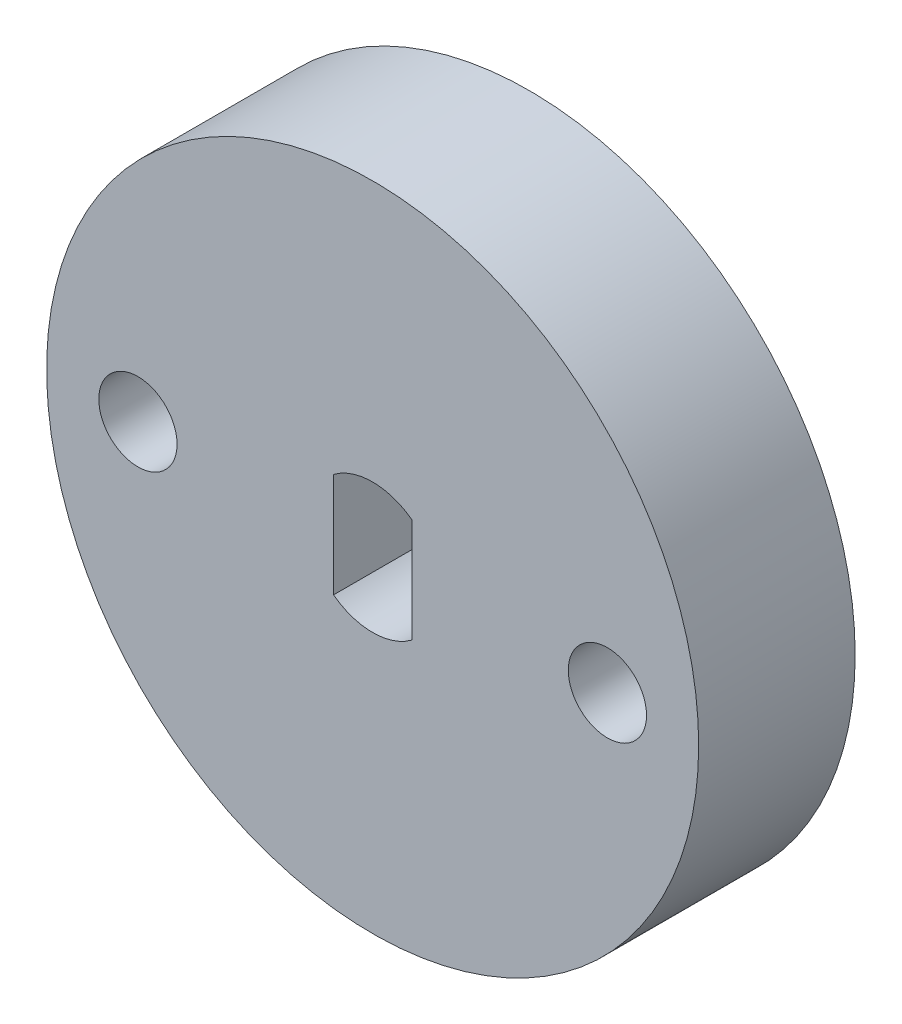
ISO-10303-21;
HEADER;
FILE_DESCRIPTION(('STEP AP214'),'2;1');
FILE_NAME('part.step','',(''),(''),'','','');
FILE_SCHEMA(('AUTOMOTIVE_DESIGN { 1 0 10303 214 1 1 1 1 }'));
ENDSEC;
DATA;
#1=APPLICATION_CONTEXT('core data for automotive mechanical design processes');
#2=APPLICATION_PROTOCOL_DEFINITION('international standard','automotive_design',2000,#1);
#3=PRODUCT_CONTEXT('',#1,'mechanical');
#4=PRODUCT('Part','Part','',(#3));
#5=PRODUCT_RELATED_PRODUCT_CATEGORY('part','',(#4));
#6=PRODUCT_DEFINITION_FORMATION('','',#4);
#7=PRODUCT_DEFINITION_CONTEXT('part definition',#1,'design');
#8=PRODUCT_DEFINITION('design','',#6,#7);
#9=PRODUCT_DEFINITION_SHAPE('','',#8);
#10=(LENGTH_UNIT() NAMED_UNIT(*) SI_UNIT(.MILLI.,.METRE.));
#11=(NAMED_UNIT(*) PLANE_ANGLE_UNIT() SI_UNIT($,.RADIAN.));
#12=(NAMED_UNIT(*) SI_UNIT($,.STERADIAN.) SOLID_ANGLE_UNIT());
#13=UNCERTAINTY_MEASURE_WITH_UNIT(LENGTH_MEASURE(1.E-05),#10,'distance_accuracy_value','');
#14=(GEOMETRIC_REPRESENTATION_CONTEXT(3) GLOBAL_UNCERTAINTY_ASSIGNED_CONTEXT((#13)) GLOBAL_UNIT_ASSIGNED_CONTEXT((#10,
#11,#12)) REPRESENTATION_CONTEXT('',''));
#15=CARTESIAN_POINT('',(0.,0.,0.));
#16=DIRECTION('',(0.,0.,1.));
#17=DIRECTION('',(1.,0.,0.));
#18=AXIS2_PLACEMENT_3D('',#15,#16,#17);
#19=CARTESIAN_POINT('',(-1.5,0.,6.));
#20=DIRECTION('',(1.,0.,0.));
#21=DIRECTION('',(0.,0.,-1.));
#22=AXIS2_PLACEMENT_3D('',#19,#20,#21);
#23=PLANE('',#22);
#24=DIRECTION('',(0.,-1.,0.));
#25=VECTOR('',#24,1.);
#26=CARTESIAN_POINT('',(-1.5,0.,0.));
#27=LINE('',#26,#25);
#28=CARTESIAN_POINT('',(-1.5,2.,0.));
#29=VERTEX_POINT('',#28);
#30=CARTESIAN_POINT('',(-1.5,-2.,0.));
#31=VERTEX_POINT('',#30);
#32=EDGE_CURVE('E108',#29,#31,#27,.T.);
#33=ORIENTED_EDGE('',*,*,#32,.F.);
#34=DIRECTION('',(0.,0.,-1.));
#35=VECTOR('',#34,1.);
#36=CARTESIAN_POINT('',(-1.5,2.,6.));
#37=LINE('',#36,#35);
#38=CARTESIAN_POINT('',(-1.5,2.,6.));
#39=VERTEX_POINT('',#38);
#40=EDGE_CURVE('E11',#39,#29,#37,.T.);
#41=ORIENTED_EDGE('',*,*,#40,.F.);
#42=DIRECTION('',(0.,-1.,0.));
#43=VECTOR('',#42,1.);
#44=CARTESIAN_POINT('',(-1.5,0.,6.));
#45=LINE('',#44,#43);
#46=CARTESIAN_POINT('',(-1.5,-2.,6.));
#47=VERTEX_POINT('',#46);
#48=EDGE_CURVE('E93',#39,#47,#45,.T.);
#49=ORIENTED_EDGE('',*,*,#48,.T.);
#50=DIRECTION('',(0.,0.,-1.));
#51=VECTOR('',#50,1.);
#52=CARTESIAN_POINT('',(-1.5,-2.,6.));
#53=LINE('',#52,#51);
#54=EDGE_CURVE('E50',#47,#31,#53,.T.);
#55=ORIENTED_EDGE('',*,*,#54,.T.);
#56=EDGE_LOOP('',(#33,#41,#49,#55));
#57=FACE_BOUND('',#56,.T.);
#58=ADVANCED_FACE('F34',(#57),#23,.T.);
#59=CARTESIAN_POINT('',(0.,0.,6.));
#60=DIRECTION('',(0.,0.,-1.));
#61=DIRECTION('',(-1.,0.,0.));
#62=AXIS2_PLACEMENT_3D('',#59,#60,#61);
#63=CYLINDRICAL_SURFACE('',#62,2.5);
#64=CARTESIAN_POINT('',(0.,0.,0.));
#65=DIRECTION('',(0.,0.,1.));
#66=DIRECTION('',(1.,0.,0.));
#67=AXIS2_PLACEMENT_3D('',#64,#65,#66);
#68=CIRCLE('',#67,2.5);
#69=CARTESIAN_POINT('',(1.5,2.,0.));
#70=VERTEX_POINT('',#69);
#71=EDGE_CURVE('E82',#70,#29,#68,.T.);
#72=ORIENTED_EDGE('',*,*,#71,.F.);
#73=DIRECTION('',(0.,0.,-1.));
#74=VECTOR('',#73,1.);
#75=CARTESIAN_POINT('',(1.5,2.,6.));
#76=LINE('',#75,#74);
#77=CARTESIAN_POINT('',(1.5,2.,6.));
#78=VERTEX_POINT('',#77);
#79=EDGE_CURVE('E42',#78,#70,#76,.T.);
#80=ORIENTED_EDGE('',*,*,#79,.F.);
#81=CARTESIAN_POINT('',(0.,0.,6.));
#82=DIRECTION('',(0.,0.,1.));
#83=DIRECTION('',(1.,0.,0.));
#84=AXIS2_PLACEMENT_3D('',#81,#82,#83);
#85=CIRCLE('',#84,2.5);
#86=EDGE_CURVE('E80',#78,#39,#85,.T.);
#87=ORIENTED_EDGE('',*,*,#86,.T.);
#88=ORIENTED_EDGE('',*,*,#40,.T.);
#89=EDGE_LOOP('',(#72,#80,#87,#88));
#90=FACE_BOUND('',#89,.T.);
#91=ADVANCED_FACE('F78',(#90),#63,.F.);
#92=CARTESIAN_POINT('',(1.5,0.,6.));
#93=DIRECTION('',(1.,0.,0.));
#94=DIRECTION('',(0.,0.,-1.));
#95=AXIS2_PLACEMENT_3D('',#92,#93,#94);
#96=PLANE('',#95);
#97=DIRECTION('',(0.,-1.,0.));
#98=VECTOR('',#97,1.);
#99=CARTESIAN_POINT('',(1.5,0.,0.));
#100=LINE('',#99,#98);
#101=CARTESIAN_POINT('',(1.5,-2.,0.));
#102=VERTEX_POINT('',#101);
#103=EDGE_CURVE('E111',#70,#102,#100,.T.);
#104=ORIENTED_EDGE('',*,*,#103,.T.);
#105=DIRECTION('',(0.,0.,-1.));
#106=VECTOR('',#105,1.);
#107=CARTESIAN_POINT('',(1.5,-2.,6.));
#108=LINE('',#107,#106);
#109=CARTESIAN_POINT('',(1.5,-2.,6.));
#110=VERTEX_POINT('',#109);
#111=EDGE_CURVE('E64',#110,#102,#108,.T.);
#112=ORIENTED_EDGE('',*,*,#111,.F.);
#113=DIRECTION('',(0.,-1.,0.));
#114=VECTOR('',#113,1.);
#115=CARTESIAN_POINT('',(1.5,0.,6.));
#116=LINE('',#115,#114);
#117=EDGE_CURVE('E85',#78,#110,#116,.T.);
#118=ORIENTED_EDGE('',*,*,#117,.F.);
#119=ORIENTED_EDGE('',*,*,#79,.T.);
#120=EDGE_LOOP('',(#104,#112,#118,#119));
#121=FACE_BOUND('',#120,.T.);
#122=ADVANCED_FACE('F86',(#121),#96,.F.);
#123=CARTESIAN_POINT('',(0.,0.,6.));
#124=DIRECTION('',(0.,0.,-1.));
#125=DIRECTION('',(-1.,0.,0.));
#126=AXIS2_PLACEMENT_3D('',#123,#124,#125);
#127=CYLINDRICAL_SURFACE('',#126,12.5);
#128=CARTESIAN_POINT('',(0.,0.,6.));
#129=DIRECTION('',(0.,0.,1.));
#130=DIRECTION('',(1.,0.,0.));
#131=AXIS2_PLACEMENT_3D('',#128,#129,#130);
#132=CIRCLE('',#131,12.5);
#133=CARTESIAN_POINT('',(12.5,0.,6.));
#134=VERTEX_POINT('',#133);
#135=EDGE_CURVE('E102',#134,#134,#132,.T.);
#136=ORIENTED_EDGE('',*,*,#135,.F.);
#137=EDGE_LOOP('',(#136));
#138=FACE_BOUND('',#137,.T.);
#139=CARTESIAN_POINT('',(0.,0.,0.));
#140=DIRECTION('',(0.,0.,1.));
#141=DIRECTION('',(1.,0.,0.));
#142=AXIS2_PLACEMENT_3D('',#139,#140,#141);
#143=CIRCLE('',#142,12.5);
#144=CARTESIAN_POINT('',(12.5,0.,0.));
#145=VERTEX_POINT('',#144);
#146=EDGE_CURVE('E119',#145,#145,#143,.T.);
#147=ORIENTED_EDGE('',*,*,#146,.T.);
#148=EDGE_LOOP('',(#147));
#149=FACE_BOUND('',#148,.T.);
#150=ADVANCED_FACE('F154',(#138,#149),#127,.T.);
#151=CARTESIAN_POINT('',(-9.,0.,6.));
#152=DIRECTION('',(0.,0.,-1.));
#153=DIRECTION('',(-1.,0.,0.));
#154=AXIS2_PLACEMENT_3D('',#151,#152,#153);
#155=CYLINDRICAL_SURFACE('',#154,1.5);
#156=CARTESIAN_POINT('',(-9.,0.,6.));
#157=DIRECTION('',(0.,0.,1.));
#158=DIRECTION('',(1.,0.,0.));
#159=AXIS2_PLACEMENT_3D('',#156,#157,#158);
#160=CIRCLE('',#159,1.5);
#161=CARTESIAN_POINT('',(-7.5,0.,6.));
#162=VERTEX_POINT('',#161);
#163=EDGE_CURVE('E99',#162,#162,#160,.T.);
#164=ORIENTED_EDGE('',*,*,#163,.T.);
#165=EDGE_LOOP('',(#164));
#166=FACE_BOUND('',#165,.T.);
#167=CARTESIAN_POINT('',(-9.,0.,0.));
#168=DIRECTION('',(0.,0.,1.));
#169=DIRECTION('',(1.,0.,0.));
#170=AXIS2_PLACEMENT_3D('',#167,#168,#169);
#171=CIRCLE('',#170,1.5);
#172=CARTESIAN_POINT('',(-7.5,0.,0.));
#173=VERTEX_POINT('',#172);
#174=EDGE_CURVE('E116',#173,#173,#171,.T.);
#175=ORIENTED_EDGE('',*,*,#174,.F.);
#176=EDGE_LOOP('',(#175));
#177=FACE_BOUND('',#176,.T.);
#178=ADVANCED_FACE('F139',(#166,#177),#155,.F.);
#179=CARTESIAN_POINT('',(0.,0.,6.));
#180=DIRECTION('',(0.,0.,-1.));
#181=DIRECTION('',(-1.,0.,0.));
#182=AXIS2_PLACEMENT_3D('',#179,#180,#181);
#183=CYLINDRICAL_SURFACE('',#182,2.5);
#184=CARTESIAN_POINT('',(0.,0.,0.));
#185=DIRECTION('',(0.,0.,1.));
#186=DIRECTION('',(1.,0.,0.));
#187=AXIS2_PLACEMENT_3D('',#184,#185,#186);
#188=CIRCLE('',#187,2.5);
#189=EDGE_CURVE('E113',#31,#102,#188,.T.);
#190=ORIENTED_EDGE('',*,*,#189,.F.);
#191=ORIENTED_EDGE('',*,*,#54,.F.);
#192=CARTESIAN_POINT('',(0.,0.,6.));
#193=DIRECTION('',(0.,0.,1.));
#194=DIRECTION('',(1.,0.,0.));
#195=AXIS2_PLACEMENT_3D('',#192,#193,#194);
#196=CIRCLE('',#195,2.5);
#197=EDGE_CURVE('E89',#47,#110,#196,.T.);
#198=ORIENTED_EDGE('',*,*,#197,.T.);
#199=ORIENTED_EDGE('',*,*,#111,.T.);
#200=EDGE_LOOP('',(#190,#191,#198,#199));
#201=FACE_BOUND('',#200,.T.);
#202=ADVANCED_FACE('F131',(#201),#183,.F.);
#203=CARTESIAN_POINT('',(9.,0.,6.));
#204=DIRECTION('',(0.,0.,-1.));
#205=DIRECTION('',(-1.,0.,0.));
#206=AXIS2_PLACEMENT_3D('',#203,#204,#205);
#207=CYLINDRICAL_SURFACE('',#206,1.5);
#208=CARTESIAN_POINT('',(9.,0.,6.));
#209=DIRECTION('',(0.,0.,1.));
#210=DIRECTION('',(1.,0.,0.));
#211=AXIS2_PLACEMENT_3D('',#208,#209,#210);
#212=CIRCLE('',#211,1.5);
#213=CARTESIAN_POINT('',(10.5,0.,6.));
#214=VERTEX_POINT('',#213);
#215=EDGE_CURVE('E105',#214,#214,#212,.T.);
#216=ORIENTED_EDGE('',*,*,#215,.T.);
#217=EDGE_LOOP('',(#216));
#218=FACE_BOUND('',#217,.T.);
#219=CARTESIAN_POINT('',(9.,0.,0.));
#220=DIRECTION('',(0.,0.,1.));
#221=DIRECTION('',(1.,0.,0.));
#222=AXIS2_PLACEMENT_3D('',#219,#220,#221);
#223=CIRCLE('',#222,1.5);
#224=CARTESIAN_POINT('',(10.5,0.,0.));
#225=VERTEX_POINT('',#224);
#226=EDGE_CURVE('E95',#225,#225,#223,.T.);
#227=ORIENTED_EDGE('',*,*,#226,.F.);
#228=EDGE_LOOP('',(#227));
#229=FACE_BOUND('',#228,.T.);
#230=ADVANCED_FACE('F129',(#218,#229),#207,.F.);
#231=CARTESIAN_POINT('',(0.,0.,6.));
#232=DIRECTION('',(0.,0.,1.));
#233=DIRECTION('',(1.,0.,0.));
#234=AXIS2_PLACEMENT_3D('',#231,#232,#233);
#235=PLANE('',#234);
#236=ORIENTED_EDGE('',*,*,#48,.F.);
#237=ORIENTED_EDGE('',*,*,#86,.F.);
#238=ORIENTED_EDGE('',*,*,#117,.T.);
#239=ORIENTED_EDGE('',*,*,#197,.F.);
#240=EDGE_LOOP('',(#236,#237,#238,#239));
#241=FACE_BOUND('',#240,.T.);
#242=ORIENTED_EDGE('',*,*,#163,.F.);
#243=EDGE_LOOP('',(#242));
#244=FACE_BOUND('',#243,.T.);
#245=ORIENTED_EDGE('',*,*,#135,.T.);
#246=EDGE_LOOP('',(#245));
#247=FACE_BOUND('',#246,.T.);
#248=ORIENTED_EDGE('',*,*,#215,.F.);
#249=EDGE_LOOP('',(#248));
#250=FACE_BOUND('',#249,.T.);
#251=ADVANCED_FACE('F91',(#241,#244,#247,#250),#235,.T.);
#252=CARTESIAN_POINT('',(0.,0.,0.));
#253=DIRECTION('',(0.,0.,1.));
#254=DIRECTION('',(1.,0.,0.));
#255=AXIS2_PLACEMENT_3D('',#252,#253,#254);
#256=PLANE('',#255);
#257=ORIENTED_EDGE('',*,*,#32,.T.);
#258=ORIENTED_EDGE('',*,*,#189,.T.);
#259=ORIENTED_EDGE('',*,*,#103,.F.);
#260=ORIENTED_EDGE('',*,*,#71,.T.);
#261=EDGE_LOOP('',(#257,#258,#259,#260));
#262=FACE_BOUND('',#261,.T.);
#263=ORIENTED_EDGE('',*,*,#174,.T.);
#264=EDGE_LOOP('',(#263));
#265=FACE_BOUND('',#264,.T.);
#266=ORIENTED_EDGE('',*,*,#146,.F.);
#267=EDGE_LOOP('',(#266));
#268=FACE_BOUND('',#267,.T.);
#269=ORIENTED_EDGE('',*,*,#226,.T.);
#270=EDGE_LOOP('',(#269));
#271=FACE_BOUND('',#270,.T.);
#272=ADVANCED_FACE('F127',(#262,#265,#268,#271),#256,.F.);
#273=CLOSED_SHELL('',(#58,#91,#122,#150,#178,#202,#230,#251,#272));
#274=MANIFOLD_SOLID_BREP('B2',#273);
#275=ADVANCED_BREP_SHAPE_REPRESENTATION('',(#18,#274),#14);
#276=SHAPE_DEFINITION_REPRESENTATION(#9,#275);
ENDSEC;
END-ISO-10303-21;
